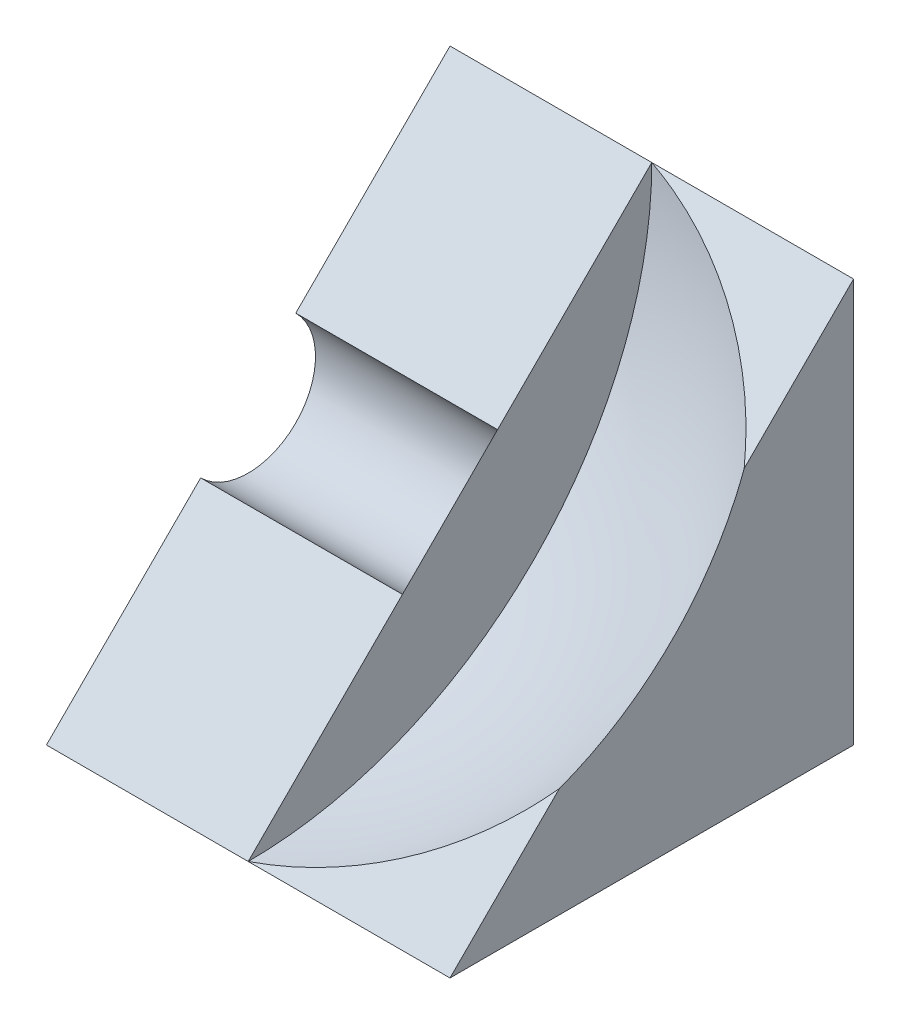
ISO-10303-21;
HEADER;
FILE_DESCRIPTION(('STEP AP214'),'2;1');
FILE_NAME('part.step','',(''),(''),'','','');
FILE_SCHEMA(('AUTOMOTIVE_DESIGN { 1 0 10303 214 1 1 1 1 }'));
ENDSEC;
DATA;
#1=APPLICATION_CONTEXT('core data for automotive mechanical design processes');
#2=APPLICATION_PROTOCOL_DEFINITION('international standard','automotive_design',2000,#1);
#3=PRODUCT_CONTEXT('',#1,'mechanical');
#4=PRODUCT('Part','Part','',(#3));
#5=PRODUCT_RELATED_PRODUCT_CATEGORY('part','',(#4));
#6=PRODUCT_DEFINITION_FORMATION('','',#4);
#7=PRODUCT_DEFINITION_CONTEXT('part definition',#1,'design');
#8=PRODUCT_DEFINITION('design','',#6,#7);
#9=PRODUCT_DEFINITION_SHAPE('','',#8);
#10=(LENGTH_UNIT() NAMED_UNIT(*) SI_UNIT(.MILLI.,.METRE.));
#11=(NAMED_UNIT(*) PLANE_ANGLE_UNIT() SI_UNIT($,.RADIAN.));
#12=(NAMED_UNIT(*) SI_UNIT($,.STERADIAN.) SOLID_ANGLE_UNIT());
#13=UNCERTAINTY_MEASURE_WITH_UNIT(LENGTH_MEASURE(1.E-05),#10,'distance_accuracy_value','');
#14=(GEOMETRIC_REPRESENTATION_CONTEXT(3) GLOBAL_UNCERTAINTY_ASSIGNED_CONTEXT((#13)) GLOBAL_UNIT_ASSIGNED_CONTEXT((#10,
#11,#12)) REPRESENTATION_CONTEXT('',''));
#15=CARTESIAN_POINT('',(0.,0.,0.));
#16=DIRECTION('',(0.,0.,1.));
#17=DIRECTION('',(1.,0.,0.));
#18=AXIS2_PLACEMENT_3D('',#15,#16,#17);
#19=CARTESIAN_POINT('',(85.,0.,59.99995));
#20=DIRECTION('',(0.,-0.70710707581468,-0.707106486558292));
#21=DIRECTION('',(0.,0.707106486558292,-0.70710707581468));
#22=AXIS2_PLACEMENT_3D('',#19,#20,#21);
#23=PLANE('',#22);
#24=CARTESIAN_POINT('',(29.9998,-5.1781123658666E-05,60.0000017811668));
#25=CARTESIAN_POINT('',(30.7075501017135,0.14654215159605,59.8534077262853));
#26=CARTESIAN_POINT('',(31.4110715698133,0.30314837625269,59.6968013711232));
#27=CARTESIAN_POINT('',(32.8086429667047,0.636266122760503,59.3636833470168));
#28=CARTESIAN_POINT('',(33.502692667805,0.812778122184188,59.1871712004996));
#29=CARTESIAN_POINT('',(35.5692390203095,1.37203048303115,58.6279183736082));
#30=CARTESIAN_POINT('',(36.9259504460386,1.78444945888903,58.2154990540673));
#31=CARTESIAN_POINT('',(39.5967446522564,2.68991853420449,57.310029224193));
#32=CARTESIAN_POINT('',(40.9104353927401,3.18354544419467,56.8164019028464));
#33=CARTESIAN_POINT('',(43.4743740622767,4.24713331774656,55.7528131429698));
#34=CARTESIAN_POINT('',(44.7246309538304,4.81708345603521,55.1828625297219));
#35=CARTESIAN_POINT('',(47.1542875204291,6.03238892460419,53.9675560483966));
#36=CARTESIAN_POINT('',(48.3335050164744,6.67792658930182,53.3220178457501));
#37=CARTESIAN_POINT('',(50.606875518546,8.04053280990178,51.959410489643));
#38=CARTESIAN_POINT('',(51.7010070921825,8.75761928513349,51.2423234168383));
#39=CARTESIAN_POINT('',(53.7869306309738,10.2560077223317,49.7439337309809));
#40=CARTESIAN_POINT('',(54.7791863920909,11.0369866502539,48.9629541522419));
#41=CARTESIAN_POINT('',(56.6541696629981,12.6614591635084,47.338480285258));
#42=CARTESIAN_POINT('',(57.5369931206411,13.5048969347006,46.4950418111998));
#43=CARTESIAN_POINT('',(58.6476660316205,14.6837584917256,45.3161792717886));
#44=CARTESIAN_POINT('',(58.9292890517796,14.9942740625198,45.005663442231));
#45=CARTESIAN_POINT('',(59.4767196027434,15.6220704863148,44.3778664952714));
#46=CARTESIAN_POINT('',(59.7425318069019,15.9393493021945,44.0605874149922));
#47=CARTESIAN_POINT('',(60.000225,16.2599595985482,43.7399768514629));
#48=B_SPLINE_CURVE_WITH_KNOTS('',3,(#24,#25,#26,#27,#28,#29,#30,#31,#32,#33,#34,#35,#36,#37,#38,
#39,#40,#41,#42,#43,#44,#45,#46,#47),.UNSPECIFIED.,.F.,.F.,(4,2,2,2,2,2,2,2,2,2,2,4),(0.,
2.21215957823001,4.42437224112848,8.84936625624993,13.3072670116011,17.7645361508409,
22.2327877777657,26.7021612963625,31.1501900926085,35.594290946876,37.1590825375816,
38.7234092856686),.UNSPECIFIED.);
#49=CARTESIAN_POINT('',(30.0000364707696,9.90699170863443E-07,59.9999307739114));
#50=VERTEX_POINT('',#49);
#51=CARTESIAN_POINT('',(30.0002913958802,4.9999958334239E-05,59.9999));
#52=VERTEX_POINT('',#51);
#53=EDGE_CURVE('E131',#50,#52,#48,.T.);
#54=ORIENTED_EDGE('',*,*,#53,.F.);
#55=DIRECTION('',(-1.,0.,0.));
#56=VECTOR('',#55,1.);
#57=CARTESIAN_POINT('',(85.,0.,59.99995));
#58=LINE('',#57,#56);
#59=CARTESIAN_POINT('',(60.,0.,59.99995));
#60=VERTEX_POINT('',#59);
#61=EDGE_CURVE('E165',#60,#50,#58,.T.);
#62=ORIENTED_EDGE('',*,*,#61,.F.);
#63=DIRECTION('',(0.,-0.707106486558292,0.70710707581468));
#64=VECTOR('',#63,1.);
#65=CARTESIAN_POINT('',(60.,-2.50000000041797E-05,59.9999750000208));
#66=LINE('',#65,#64);
#67=CARTESIAN_POINT('',(60.,16.2596796603646,43.7402567898797));
#68=VERTEX_POINT('',#67);
#69=EDGE_CURVE('E183',#68,#60,#66,.T.);
#70=ORIENTED_EDGE('',*,*,#69,.F.);
#71=EDGE_CURVE('E59',#52,#68,#48,.T.);
#72=ORIENTED_EDGE('',*,*,#71,.F.);
#73=EDGE_LOOP('',(#54,#62,#70,#72));
#74=FACE_BOUND('',#73,.T.);
#75=ADVANCED_FACE('F43',(#74),#23,.F.);
#76=CARTESIAN_POINT('',(60.000225,43.7399369097462,16.2599766402456));
#77=CARTESIAN_POINT('',(59.3844415223114,44.5061305786427,15.4937823328533));
#78=CARTESIAN_POINT('',(58.7221450644905,45.253327214195,14.7465850746361));
#79=CARTESIAN_POINT('',(57.3129519361885,46.7060616456861,13.293849432531));
#80=CARTESIAN_POINT('',(56.5661088783935,47.4116254147645,12.5882850754818));
#81=CARTESIAN_POINT('',(54.997564731696,48.7765648236264,11.2233445291685));
#82=CARTESIAN_POINT('',(54.1760704842793,49.4360596411124,10.5638491621025));
#83=CARTESIAN_POINT('',(52.4637754270321,50.7085549169874,9.2913528258131));
#84=CARTESIAN_POINT('',(51.5729626073562,51.3215472820608,8.67835994991187));
#85=CARTESIAN_POINT('',(49.6806322301687,52.529740649659,7.47016557548412));
#86=CARTESIAN_POINT('',(48.6757564949494,53.1223109183581,6.87759481297569));
#87=CARTESIAN_POINT('',(46.6047924463428,54.2513056469047,5.74859914359855));
#88=CARTESIAN_POINT('',(45.5387006703002,54.7877269258579,5.21217741762688));
#89=CARTESIAN_POINT('',(43.352219105635,55.8027849074502,4.1971185901515));
#90=CARTESIAN_POINT('',(42.2318053471819,56.2813957697124,3.71850732904632));
#91=CARTESIAN_POINT('',(39.9445047113908,57.1788585125453,2.8210438383265));
#92=CARTESIAN_POINT('',(38.7776293952838,57.5977251421244,2.40217685969136));
#93=CARTESIAN_POINT('',(36.3617796722984,58.3882945398994,1.61160680310735));
#94=CARTESIAN_POINT('',(35.1113613500782,58.7577906183774,1.24211041671545));
#95=CARTESIAN_POINT('',(32.5784602213533,59.4293047392637,0.570595736233094));
#96=CARTESIAN_POINT('',(31.2960683154422,59.7314941616912,0.268406061980658));
#97=CARTESIAN_POINT('',(29.9998,59.9999414247473,-4.1424781852638E-05));
#98=B_SPLINE_CURVE_WITH_KNOTS('',3,(#76,#77,#78,#79,#80,#81,#82,#83,#84,#85,#86,#87,#88,#89,#90,
#91,#92,#93,#94,#95,#96,#97),.UNSPECIFIED.,.F.,.F.,(4,2,2,2,2,2,2,2,2,2,4),(0.,3.73724174160161,
7.47212675993812,11.1969616631996,14.9224433588073,18.8438358241679,22.7654503200972,
26.6888112817308,30.6112020039389,34.6730668368085,38.7244677798828),.UNSPECIFIED.);
#99=CARTESIAN_POINT('',(60.,43.7402168478734,16.2596967018952));
#100=VERTEX_POINT('',#99);
#101=CARTESIAN_POINT('',(30.,59.9998999999167,8.33291768920219E-11));
#102=VERTEX_POINT('',#101);
#103=EDGE_CURVE('E121',#100,#102,#98,.T.);
#104=ORIENTED_EDGE('',*,*,#103,.F.);
#105=CARTESIAN_POINT('',(60.,59.9999,0.));
#106=VERTEX_POINT('',#105);
#107=EDGE_CURVE('E160',#106,#100,#66,.T.);
#108=ORIENTED_EDGE('',*,*,#107,.F.);
#109=DIRECTION('',(-1.,0.,0.));
#110=VECTOR('',#109,1.);
#111=CARTESIAN_POINT('',(85.,59.9999,0.));
#112=LINE('',#111,#110);
#113=EDGE_CURVE('E152',#106,#102,#112,.T.);
#114=ORIENTED_EDGE('',*,*,#113,.T.);
#115=EDGE_LOOP('',(#104,#108,#114));
#116=FACE_BOUND('',#115,.T.);
#117=ADVANCED_FACE('F159',(#116),#23,.F.);
#118=CARTESIAN_POINT('',(30.,60.0001,-0.00020000016666584));
#119=CARTESIAN_POINT('',(29.9999984336098,45.8579231283649,14.1419886566354));
#120=CARTESIAN_POINT('',(30.0000063081696,31.7157462567347,28.2841773134327));
#121=CARTESIAN_POINT('',(30.0000307960496,11.7156462567457,48.2842939801995));
#122=CARTESIAN_POINT('',(30.0000395882537,5.85772312838283,54.1422219901731));
#123=CARTESIAN_POINT('',(30.0000500002917,-0.000199999979198746,60.0001500001459));
#124=B_SPLINE_CURVE_WITH_KNOTS('',3,(#118,#119,#120,#121,#122,#123),.UNSPECIFIED.,.F.,.F.,(4,2,
4),(0.,60.0002000001401,84.8532733620257),.UNSPECIFIED.);
#125=CARTESIAN_POINT('',(30.0000054316123,37.0710304904511,22.9288886169737));
#126=VERTEX_POINT('',#125);
#127=EDGE_CURVE('E136',#102,#126,#124,.T.);
#128=ORIENTED_EDGE('',*,*,#127,.F.);
#129=CARTESIAN_POINT('',(0.,59.9999,0.));
#130=VERTEX_POINT('',#129);
#131=EDGE_CURVE('E144',#102,#130,#112,.T.);
#132=ORIENTED_EDGE('',*,*,#131,.T.);
#133=DIRECTION('',(0.,-0.707106486558292,0.70710707581468));
#134=VECTOR('',#133,1.);
#135=CARTESIAN_POINT('',(0.,0.,59.99995));
#136=LINE('',#135,#134);
#137=CARTESIAN_POINT('',(0.,37.0710304904503,22.9288886169728));
#138=VERTEX_POINT('',#137);
#139=EDGE_CURVE('E162',#130,#138,#136,.T.);
#140=ORIENTED_EDGE('',*,*,#139,.T.);
#141=DIRECTION('',(-1.,0.,0.));
#142=VECTOR('',#141,1.);
#143=CARTESIAN_POINT('',(30.,37.0710304904503,22.9288886169728));
#144=LINE('',#143,#142);
#145=EDGE_CURVE('E67',#138,#126,#144,.F.);
#146=ORIENTED_EDGE('',*,*,#145,.T.);
#147=EDGE_LOOP('',(#128,#132,#140,#146));
#148=FACE_BOUND('',#147,.T.);
#149=ADVANCED_FACE('F142',(#148),#23,.F.);
#150=EDGE_CURVE('E138',#126,#50,#124,.T.);
#151=ORIENTED_EDGE('',*,*,#150,.F.);
#152=DIRECTION('',(0.,0.707106486558292,-0.70710707581468));
#153=VECTOR('',#152,1.);
#154=CARTESIAN_POINT('',(30.,0.,59.99995));
#155=LINE('',#154,#153);
#156=CARTESIAN_POINT('',(30.,22.9289007595178,37.071030133033));
#157=VERTEX_POINT('',#156);
#158=EDGE_CURVE('E12',#157,#126,#155,.T.);
#159=ORIENTED_EDGE('',*,*,#158,.F.);
#160=DIRECTION('',(-1.,0.,0.));
#161=VECTOR('',#160,1.);
#162=CARTESIAN_POINT('',(30.,22.9289007595178,37.071030133033));
#163=LINE('',#162,#161);
#164=CARTESIAN_POINT('',(0.,22.9289007595178,37.071030133033));
#165=VERTEX_POINT('',#164);
#166=EDGE_CURVE('E157',#157,#165,#163,.T.);
#167=ORIENTED_EDGE('',*,*,#166,.T.);
#168=CARTESIAN_POINT('',(0.,2.50000208271501E-05,59.999975));
#169=VERTEX_POINT('',#168);
#170=EDGE_CURVE('E161',#165,#169,#136,.T.);
#171=ORIENTED_EDGE('',*,*,#170,.T.);
#172=CARTESIAN_POINT('',(30.,0.,59.99995));
#173=DIRECTION('',(-1.,0.,0.));
#174=VECTOR('',#173,1.);
#175=LINE('',#172,#174);
#176=EDGE_CURVE('E273',#50,#169,#175,.T.);
#177=ORIENTED_EDGE('',*,*,#176,.F.);
#178=EDGE_LOOP('',(#151,#159,#167,#171,#177));
#179=FACE_BOUND('',#178,.T.);
#180=ADVANCED_FACE('F221',(#179),#23,.F.);
#181=CARTESIAN_POINT('',(60.,0.,60.));
#182=DIRECTION('',(-1.,0.,0.));
#183=DIRECTION('',(0.,0.,1.));
#184=AXIS2_PLACEMENT_3D('',#181,#182,#183);
#185=PLANE('',#184);
#186=CARTESIAN_POINT('',(60.,27.0030565653427,27.0030837840858));
#187=CARTESIAN_POINT('',(60.,27.8815241833327,26.1246241588315));
#188=CARTESIAN_POINT('',(60.,28.7952038700235,25.281146576921));
#189=CARTESIAN_POINT('',(60.,30.687047048745,23.6697084677748));
#190=CARTESIAN_POINT('',(60.,31.6652213859136,22.9017606956759));
#191=CARTESIAN_POINT('',(60.,33.6806779052198,21.4456903390772));
#192=CARTESIAN_POINT('',(60.,34.7180133660953,20.7576414574266));
#193=CARTESIAN_POINT('',(60.,36.8442979040572,19.466615730743));
#194=CARTESIAN_POINT('',(60.,37.9332465182822,18.8636381229924));
#195=CARTESIAN_POINT('',(60.,40.2167569729813,17.7159735242071));
#196=CARTESIAN_POINT('',(60.,41.4138366420649,17.1762881762569));
#197=CARTESIAN_POINT('',(60.,43.8492481711442,16.1996651717968));
#198=CARTESIAN_POINT('',(60.,45.0875820661537,15.7627325925323));
#199=CARTESIAN_POINT('',(60.,47.5965898461612,14.9947650089843));
#200=CARTESIAN_POINT('',(60.,48.8672618712413,14.6637239291754));
#201=CARTESIAN_POINT('',(60.,51.4319594719834,14.1098654702487));
#202=CARTESIAN_POINT('',(60.,52.7259847599509,13.8870467588567));
#203=CARTESIAN_POINT('',(60.,55.3282380283316,13.5512059645342));
#204=CARTESIAN_POINT('',(60.,56.6364663539308,13.4381865561988));
#205=CARTESIAN_POINT('',(60.,59.2577974602142,13.3227573942381));
#206=CARTESIAN_POINT('',(60.,60.5709002553585,13.3203479689972));
#207=CARTESIAN_POINT('',(60.,63.1926389449041,13.4261565731029));
#208=CARTESIAN_POINT('',(60.,64.5012748467835,13.5343744171548));
#209=CARTESIAN_POINT('',(60.,67.1047774269789,13.8606678207731));
#210=CARTESIAN_POINT('',(60.,68.3996441146766,14.0787433054821));
#211=CARTESIAN_POINT('',(60.,70.9664021858641,14.623201291212));
#212=CARTESIAN_POINT('',(60.,72.2382935922371,14.9495836843541));
#213=CARTESIAN_POINT('',(60.,74.7500602514152,15.7083352234821));
#214=CARTESIAN_POINT('',(60.,75.9899354995041,16.1407043850806));
#215=CARTESIAN_POINT('',(60.,78.4288585620879,17.1083570113837));
#216=CARTESIAN_POINT('',(60.,79.62790625422,17.6436407844983));
#217=CARTESIAN_POINT('',(60.,81.9766457334035,18.8133162258413));
#218=CARTESIAN_POINT('',(60.,83.1263375217424,19.4477078914846));
#219=CARTESIAN_POINT('',(60.,85.3681907272418,20.8110884490453));
#220=CARTESIAN_POINT('',(60.,86.4603521882824,21.5400772688092));
#221=CARTESIAN_POINT('',(60.,88.57938106006,23.0874698313954));
#222=CARTESIAN_POINT('',(60.,89.6062484706591,23.9058735744065));
#223=CARTESIAN_POINT('',(60.,91.5873873197327,25.6262763134674));
#224=CARTESIAN_POINT('',(60.,92.5416588677207,26.5282751834063));
#225=CARTESIAN_POINT('',(60.,94.3708234173451,28.4094565604671));
#226=CARTESIAN_POINT('',(60.,95.2457164190523,29.3886390675202));
#227=CARTESIAN_POINT('',(60.,96.9099043228468,31.417226818686));
#228=CARTESIAN_POINT('',(60.,97.6991991836356,32.4666320966787));
#229=CARTESIAN_POINT('',(60.,99.1865789110362,34.6282043296687));
#230=CARTESIAN_POINT('',(60.,99.8846637775717,35.7403712847185));
#231=CARTESIAN_POINT('',(60.,101.184660906457,38.0195606537633));
#232=CARTESIAN_POINT('',(60.,101.78657311663,39.1865830975186));
#233=CARTESIAN_POINT('',(60.,102.889945237783,41.5671860500122));
#234=CARTESIAN_POINT('',(60.,103.391405148739,42.7807665587624));
#235=CARTESIAN_POINT('',(60.,104.290307505411,45.2458575738944));
#236=CARTESIAN_POINT('',(60.,104.6877499707,46.4973680731395));
#237=CARTESIAN_POINT('',(60.,105.375791981346,49.0294217954605));
#238=CARTESIAN_POINT('',(60.,105.666391526743,50.3099650185256));
#239=CARTESIAN_POINT('',(60.,106.138681669569,52.8909800771902));
#240=CARTESIAN_POINT('',(60.,106.320372285123,54.1914519094729));
#241=CARTESIAN_POINT('',(60.,106.573552932593,56.8030788209562));
#242=CARTESIAN_POINT('',(60.,106.64504296451,58.1142339001565));
#243=CARTESIAN_POINT('',(60.,106.677314194546,60.737905858605));
#244=CARTESIAN_POINT('',(60.,106.638095386033,62.0504227379346));
#245=CARTESIAN_POINT('',(60.,106.449227743081,64.6674870100601));
#246=CARTESIAN_POINT('',(60.,106.299578908632,65.9720344028553));
#247=CARTESIAN_POINT('',(60.,105.890915117839,68.5638852125254));
#248=CARTESIAN_POINT('',(60.,105.631900156387,69.8511886285946));
#249=CARTESIAN_POINT('',(60.,105.006345552082,72.3993994661301));
#250=CARTESIAN_POINT('',(60.,104.639805909228,73.660306887596));
#251=CARTESIAN_POINT('',(60.,103.801807825544,76.1467614216089));
#252=CARTESIAN_POINT('',(60.,103.330349386199,77.3723085346566));
#253=CARTESIAN_POINT('',(60.,102.285865493567,79.7793295645343));
#254=CARTESIAN_POINT('',(60.,101.712840040283,80.9608034813655));
#255=CARTESIAN_POINT('',(60.,100.469295999058,83.2712785257531));
#256=CARTESIAN_POINT('',(60.,99.7987774129118,84.4002796542758));
#257=CARTESIAN_POINT('',(60.,98.3650140833319,86.5977826237667));
#258=CARTESIAN_POINT('',(60.,97.6017693398995,87.6662844647361));
#259=CARTESIAN_POINT('',(60.,95.9879799142822,89.7351924441009));
#260=CARTESIAN_POINT('',(60.,95.1374352327155,90.7355985829787));
#261=CARTESIAN_POINT('',(60.,93.3550927891557,92.6612028783633));
#262=CARTESIAN_POINT('',(60.,92.4232950271617,93.5864010348694));
#263=CARTESIAN_POINT('',(60.,90.4850709148135,95.3550117900581));
#264=CARTESIAN_POINT('',(60.,89.4786445620283,96.1984243860768));
#265=CARTESIAN_POINT('',(60.,87.398318383322,97.797467827651));
#266=CARTESIAN_POINT('',(60.,86.3244185573965,98.5530986732009));
#267=CARTESIAN_POINT('',(60.,84.1167801750315,99.9712065581468));
#268=CARTESIAN_POINT('',(60.,82.983041616313,100.633683593995));
#269=CARTESIAN_POINT('',(60.,80.6637860085812,101.86077400998));
#270=CARTESIAN_POINT('',(60.,79.4782689595694,102.425387390119));
#271=CARTESIAN_POINT('',(60.,77.0638848195076,103.452736375638));
#272=CARTESIAN_POINT('',(60.,75.8350177331698,103.915471992091));
#273=CARTESIAN_POINT('',(60.,73.3426699044526,104.735775755496));
#274=CARTESIAN_POINT('',(60.,72.0791891620806,105.09334390247));
#275=CARTESIAN_POINT('',(60.,69.5265967595927,105.700770596812));
#276=CARTESIAN_POINT('',(60.,68.2374851024536,105.950629156691));
#277=CARTESIAN_POINT('',(60.,65.6427955363699,106.340860393069));
#278=CARTESIAN_POINT('',(60.,64.3372176274238,106.481233069558));
#279=CARTESIAN_POINT('',(60.,61.7188769846141,106.651494602916));
#280=CARTESIAN_POINT('',(60.,60.4061142483018,106.681383422125));
#281=CARTESIAN_POINT('',(60.,57.7827373516399,106.630464644721));
#282=CARTESIAN_POINT('',(60.,56.4721231912917,106.549657048038));
#283=CARTESIAN_POINT('',(60.,53.8623607719239,106.277919895162));
#284=CARTESIAN_POINT('',(60.,52.5632125160639,106.086990308626));
#285=CARTESIAN_POINT('',(60.,49.9856184462165,105.596366548816));
#286=CARTESIAN_POINT('',(60.,48.7071726322202,105.29667237559));
#287=CARTESIAN_POINT('',(60.,46.1800735653989,104.590650405755));
#288=CARTESIAN_POINT('',(60.,44.9314202860087,104.184322704233));
#289=CARTESIAN_POINT('',(60.,42.4727822771827,103.267922297225));
#290=CARTESIAN_POINT('',(60.,41.2627975477038,102.757849591855));
#291=CARTESIAN_POINT('',(60.,38.8900992772033,101.637585664949));
#292=CARTESIAN_POINT('',(60.,37.7273857210211,101.027394475521));
#293=CARTESIAN_POINT('',(60.,35.4574955691754,99.7112315516458));
#294=CARTESIAN_POINT('',(60.,34.3503189735673,99.0052598171026));
#295=CARTESIAN_POINT('',(60.,32.199372443418,97.5025536782945));
#296=CARTESIAN_POINT('',(60.,31.1556026061049,96.7058191348591));
#297=CARTESIAN_POINT('',(60.,29.1388920271862,95.0272525663696));
#298=CARTESIAN_POINT('',(60.,28.1659512856051,94.1454205412862));
#299=CARTESIAN_POINT('',(60.,26.2978174122471,92.3029297744102));
#300=CARTESIAN_POINT('',(60.,25.4026241575813,91.3422711572166));
#301=CARTESIAN_POINT('',(60.,23.6963478111576,89.3489556937655));
#302=CARTESIAN_POINT('',(60.,22.8852647194695,88.3162988474481));
#303=CARTESIAN_POINT('',(60.,21.3529737522374,86.1863267429865));
#304=CARTESIAN_POINT('',(60.,20.631766023505,85.0890113792269));
#305=CARTESIAN_POINT('',(60.,19.2843547051817,82.8375250608429));
#306=CARTESIAN_POINT('',(60.,18.6581511141056,81.6833541071074));
#307=CARTESIAN_POINT('',(60.,17.5051910402753,79.3263437574638));
#308=CARTESIAN_POINT('',(60.,16.9784361012337,78.1235036064298));
#309=CARTESIAN_POINT('',(60.,16.0281303332011,75.6777231977864));
#310=CARTESIAN_POINT('',(60.,15.6045795213786,74.4347829335061));
#311=CARTESIAN_POINT('',(60.,14.8637054479783,71.917680264905));
#312=CARTESIAN_POINT('',(60.,14.546378737611,70.6435188756855));
#313=CARTESIAN_POINT('',(60.,14.020190079864,68.0729943813456));
#314=CARTESIAN_POINT('',(60.,13.811328038751,66.7766312954124));
#315=CARTESIAN_POINT('',(60.,13.5035668527558,64.1710346126222));
#316=CARTESIAN_POINT('',(60.,13.4046579127234,62.8618021727136));
#317=CARTESIAN_POINT('',(60.,13.3174724971384,60.2396544108722));
#318=CARTESIAN_POINT('',(60.,13.3291963931483,58.9267390765852));
#319=CARTESIAN_POINT('',(60.,13.4632084782088,56.3062819301611));
#320=CARTESIAN_POINT('',(60.,13.5855202895161,54.9987413260462));
#321=CARTESIAN_POINT('',(60.,13.9398693790154,52.3986314507958));
#322=CARTESIAN_POINT('',(60.,14.1719051635026,51.1060619760993));
#323=CARTESIAN_POINT('',(60.,14.7441587517332,48.5445830404467));
#324=CARTESIAN_POINT('',(60.,15.0844175885743,47.2756827472317));
#325=CARTESIAN_POINT('',(60.,15.8706982532688,44.7709961669276));
#326=CARTESIAN_POINT('',(60.,16.3167261438092,43.535211782565));
#327=CARTESIAN_POINT('',(60.,17.3108759234009,41.106785905384));
#328=CARTESIAN_POINT('',(60.,17.8589028893357,39.9141055212622));
#329=CARTESIAN_POINT('',(60.,19.0533784566334,37.5793025145414));
#330=CARTESIAN_POINT('',(60.,19.6998046378638,36.4371684513511));
#331=CARTESIAN_POINT('',(60.,20.8623700275712,34.5710980407771));
#332=CARTESIAN_POINT('',(60.,21.3531603125506,33.8312310997186));
#333=CARTESIAN_POINT('',(60.,22.3762164896427,32.380561729765));
#334=CARTESIAN_POINT('',(60.,22.9084871174614,31.6697626336386));
#335=CARTESIAN_POINT('',(60.,24.0126372371983,30.279767355131));
#336=CARTESIAN_POINT('',(60.,24.5845119536727,29.6005673789956));
#337=CARTESIAN_POINT('',(60.,25.7659568847067,28.275991906897));
#338=CARTESIAN_POINT('',(60.,26.3755224143458,27.6306122254646));
#339=CARTESIAN_POINT('',(60.,27.0030565653427,27.0030837840858));
#340=B_SPLINE_CURVE_WITH_KNOTS('',3,(#186,#187,#188,#189,#190,#191,#192,#193,#194,#195,#196,
#197,#198,#199,#200,#201,#202,#203,#204,#205,#206,#207,#208,#209,#210,#211,#212,#213,#214,#215,
#216,#217,#218,#219,#220,#221,#222,#223,#224,#225,#226,#227,#228,#229,#230,#231,#232,#233,#234,
#235,#236,#237,#238,#239,#240,#241,#242,#243,#244,#245,#246,#247,#248,#249,#250,#251,#252,#253,
#254,#255,#256,#257,#258,#259,#260,#261,#262,#263,#264,#265,#266,#267,#268,#269,#270,#271,#272,
#273,#274,#275,#276,#277,#278,#279,#280,#281,#282,#283,#284,#285,#286,#287,#288,#289,#290,#291,
#292,#293,#294,#295,#296,#297,#298,#299,#300,#301,#302,#303,#304,#305,#306,#307,#308,#309,#310,
#311,#312,#313,#314,#315,#316,#317,#318,#319,#320,#321,#322,#323,#324,#325,#326,#327,#328,#329,
#330,#331,#332,#333,#334,#335,#336,#337,#338,#339),.UNSPECIFIED.,.T.,.F.,(4,2,2,2,2,2,2,2,2,2,2,
2,2,2,2,2,2,2,2,2,2,2,2,2,2,2,2,2,2,2,2,2,2,2,2,2,2,2,2,2,2,2,2,2,2,2,2,2,2,2,2,2,2,2,2,2,2,2,2,
2,2,2,2,2,2,2,2,2,2,2,2,2,2,2,2,2,4),(0.,3.72629675997922,7.453221723681,11.1835577347996,
14.9138602989763,18.8484800000682,22.7832940787385,26.7178823569174,30.6524221970214,
34.5870578759588,38.521705236233,42.4563460061921,46.3909840950735,50.3256182648772,
54.2602530142817,58.1948995550148,62.1295459931249,66.0641894301199,69.9988328754202,
73.9334703850518,77.8681078911771,81.8027472956402,85.737386703396,89.6720282458149,
93.6066697892311,97.5413105923121,101.475951393909,105.410591540639,109.345231687287,
113.279872069597,117.214512452274,121.149153018784,125.083793585345,129.018434096188,
132.953074606925,136.8877150452,140.822355483402,144.75699589374,148.691636304122,
152.626276842663,156.560917381459,160.495558070104,164.430198758646,168.364839019494,
172.299479279513,176.234119082572,180.168758886011,184.103400030574,188.038041177565,
191.972683408727,195.907325638182,199.841964359088,203.776603075617,207.711240530234,
211.645877988767,215.580521480538,219.515164973669,223.449802247531,227.384439524661,
231.319083228944,235.253726871722,239.188431585814,243.123136954463,247.057714562216,
250.992288769774,254.926512438474,258.860749320344,262.795826777924,266.730850667679,
270.667368315766,274.604111659789,278.537209517678,282.469412562061,285.131642430989,
287.794176686506,290.456390451921,293.118273970162),.UNSPECIFIED.);
#341=EDGE_CURVE('E126',#68,#100,#340,.T.);
#342=ORIENTED_EDGE('',*,*,#341,.F.);
#343=ORIENTED_EDGE('',*,*,#69,.T.);
#344=DIRECTION('',(0.,0.,-1.));
#345=VECTOR('',#344,1.);
#346=CARTESIAN_POINT('',(60.,0.,60.));
#347=LINE('',#346,#345);
#348=CARTESIAN_POINT('',(60.,0.,0.));
#349=VERTEX_POINT('',#348);
#350=EDGE_CURVE('E177',#60,#349,#347,.T.);
#351=ORIENTED_EDGE('',*,*,#350,.T.);
#352=DIRECTION('',(0.,1.,0.));
#353=VECTOR('',#352,1.);
#354=CARTESIAN_POINT('',(60.,0.,0.));
#355=LINE('',#354,#353);
#356=EDGE_CURVE('E171',#349,#106,#355,.T.);
#357=ORIENTED_EDGE('',*,*,#356,.T.);
#358=ORIENTED_EDGE('',*,*,#107,.T.);
#359=EDGE_LOOP('',(#342,#343,#351,#357,#358));
#360=FACE_BOUND('',#359,.T.);
#361=ADVANCED_FACE('F290',(#360),#185,.F.);
#362=CARTESIAN_POINT('',(0.,0.,0.));
#363=DIRECTION('',(0.,0.,-1.));
#364=DIRECTION('',(-1.,0.,0.));
#365=AXIS2_PLACEMENT_3D('',#362,#363,#364);
#366=PLANE('',#365);
#367=DIRECTION('',(0.,-1.,0.));
#368=VECTOR('',#367,1.);
#369=CARTESIAN_POINT('',(0.,0.,0.));
#370=LINE('',#369,#368);
#371=CARTESIAN_POINT('',(0.,20.,0.));
#372=VERTEX_POINT('',#371);
#373=EDGE_CURVE('E156',#130,#372,#370,.T.);
#374=ORIENTED_EDGE('',*,*,#373,.F.);
#375=ORIENTED_EDGE('',*,*,#131,.F.);
#376=ORIENTED_EDGE('',*,*,#113,.F.);
#377=ORIENTED_EDGE('',*,*,#356,.F.);
#378=DIRECTION('',(1.,0.,0.));
#379=VECTOR('',#378,1.);
#380=CARTESIAN_POINT('',(0.,0.,0.));
#381=LINE('',#380,#379);
#382=CARTESIAN_POINT('',(30.,0.,0.));
#383=VERTEX_POINT('',#382);
#384=EDGE_CURVE('E194',#383,#349,#381,.T.);
#385=ORIENTED_EDGE('',*,*,#384,.F.);
#386=DIRECTION('',(0.,-1.,0.));
#387=VECTOR('',#386,1.);
#388=CARTESIAN_POINT('',(30.,0.,0.));
#389=LINE('',#388,#387);
#390=CARTESIAN_POINT('',(30.,20.,0.));
#391=VERTEX_POINT('',#390);
#392=EDGE_CURVE('E200',#391,#383,#389,.T.);
#393=ORIENTED_EDGE('',*,*,#392,.F.);
#394=DIRECTION('',(-1.,0.,0.));
#395=VECTOR('',#394,1.);
#396=CARTESIAN_POINT('',(30.,20.,0.));
#397=LINE('',#396,#395);
#398=EDGE_CURVE('E178',#391,#372,#397,.T.);
#399=ORIENTED_EDGE('',*,*,#398,.T.);
#400=EDGE_LOOP('',(#374,#375,#376,#377,#385,#393,#399));
#401=FACE_BOUND('',#400,.T.);
#402=ADVANCED_FACE('F150',(#401),#366,.T.);
#403=CARTESIAN_POINT('',(0.,0.,60.));
#404=DIRECTION('',(1.,0.,0.));
#405=DIRECTION('',(0.,0.,-1.));
#406=AXIS2_PLACEMENT_3D('',#403,#404,#405);
#407=PLANE('',#406);
#408=ORIENTED_EDGE('',*,*,#170,.F.);
#409=CARTESIAN_POINT('',(0.,30.000006250015,30.));
#410=DIRECTION('',(-1.,0.,0.));
#411=DIRECTION('',(0.,0.,1.));
#412=AXIS2_PLACEMENT_3D('',#409,#410,#411);
#413=CIRCLE('',#412,10.);
#414=EDGE_CURVE('E130',#138,#165,#413,.T.);
#415=ORIENTED_EDGE('',*,*,#414,.F.);
#416=ORIENTED_EDGE('',*,*,#139,.F.);
#417=ORIENTED_EDGE('',*,*,#373,.T.);
#418=DIRECTION('',(0.,0.707106781186548,-0.707106781186548));
#419=VECTOR('',#418,1.);
#420=CARTESIAN_POINT('',(0.,20.,0.));
#421=LINE('',#420,#419);
#422=CARTESIAN_POINT('',(0.,0.,20.));
#423=VERTEX_POINT('',#422);
#424=EDGE_CURVE('E196',#423,#372,#421,.T.);
#425=ORIENTED_EDGE('',*,*,#424,.F.);
#426=DIRECTION('',(0.,0.,-1.));
#427=VECTOR('',#426,1.);
#428=CARTESIAN_POINT('',(0.,0.,60.));
#429=LINE('',#428,#427);
#430=EDGE_CURVE('E190',#169,#423,#429,.T.);
#431=ORIENTED_EDGE('',*,*,#430,.F.);
#432=EDGE_LOOP('',(#408,#415,#416,#417,#425,#431));
#433=FACE_BOUND('',#432,.T.);
#434=ADVANCED_FACE('F281',(#433),#407,.F.);
#435=CARTESIAN_POINT('',(0.,0.,60.));
#436=DIRECTION('',(0.,1.,0.));
#437=DIRECTION('',(0.,0.,1.));
#438=AXIS2_PLACEMENT_3D('',#435,#436,#437);
#439=PLANE('',#438);
#440=ORIENTED_EDGE('',*,*,#350,.F.);
#441=ORIENTED_EDGE('',*,*,#61,.T.);
#442=ORIENTED_EDGE('',*,*,#176,.T.);
#443=ORIENTED_EDGE('',*,*,#430,.T.);
#444=DIRECTION('',(-1.,0.,0.));
#445=VECTOR('',#444,1.);
#446=CARTESIAN_POINT('',(30.,0.,20.));
#447=LINE('',#446,#445);
#448=CARTESIAN_POINT('',(30.,0.,20.));
#449=VERTEX_POINT('',#448);
#450=EDGE_CURVE('E198',#449,#423,#447,.T.);
#451=ORIENTED_EDGE('',*,*,#450,.F.);
#452=DIRECTION('',(0.,0.,1.));
#453=VECTOR('',#452,1.);
#454=CARTESIAN_POINT('',(30.,0.,20.));
#455=LINE('',#454,#453);
#456=EDGE_CURVE('E204',#383,#449,#455,.T.);
#457=ORIENTED_EDGE('',*,*,#456,.F.);
#458=ORIENTED_EDGE('',*,*,#384,.T.);
#459=EDGE_LOOP('',(#440,#441,#442,#443,#451,#457,#458));
#460=FACE_BOUND('',#459,.T.);
#461=ADVANCED_FACE('F45',(#460),#439,.F.);
#462=CARTESIAN_POINT('',(30.,20.,0.));
#463=DIRECTION('',(0.,0.707106781186547,0.707106781186547));
#464=DIRECTION('',(0.,-0.707106781186548,0.707106781186548));
#465=AXIS2_PLACEMENT_3D('',#462,#463,#464);
#466=PLANE('',#465);
#467=ORIENTED_EDGE('',*,*,#424,.T.);
#468=ORIENTED_EDGE('',*,*,#398,.F.);
#469=DIRECTION('',(0.,0.707106781186548,-0.707106781186548));
#470=VECTOR('',#469,1.);
#471=CARTESIAN_POINT('',(30.,20.,0.));
#472=LINE('',#471,#470);
#473=EDGE_CURVE('E52',#449,#391,#472,.T.);
#474=ORIENTED_EDGE('',*,*,#473,.F.);
#475=ORIENTED_EDGE('',*,*,#450,.T.);
#476=EDGE_LOOP('',(#467,#468,#474,#475));
#477=FACE_BOUND('',#476,.T.);
#478=ADVANCED_FACE('F284',(#477),#466,.F.);
#479=CARTESIAN_POINT('',(30.,0.,0.));
#480=DIRECTION('',(-1.,0.,0.));
#481=DIRECTION('',(0.,0.,1.));
#482=AXIS2_PLACEMENT_3D('',#479,#480,#481);
#483=PLANE('',#482);
#484=ORIENTED_EDGE('',*,*,#392,.T.);
#485=ORIENTED_EDGE('',*,*,#456,.T.);
#486=ORIENTED_EDGE('',*,*,#473,.T.);
#487=EDGE_LOOP('',(#484,#485,#486));
#488=FACE_BOUND('',#487,.T.);
#489=ADVANCED_FACE('F222',(#488),#483,.T.);
#490=CARTESIAN_POINT('',(30.,30.000006250015,30.));
#491=DIRECTION('',(-1.,0.,0.));
#492=DIRECTION('',(0.,0.,1.));
#493=AXIS2_PLACEMENT_3D('',#490,#491,#492);
#494=PLANE('',#493);
#495=ORIENTED_EDGE('',*,*,#158,.T.);
#496=CARTESIAN_POINT('',(30.,30.000006250015,30.));
#497=DIRECTION('',(-1.,0.,0.));
#498=DIRECTION('',(0.,0.,1.));
#499=AXIS2_PLACEMENT_3D('',#496,#497,#498);
#500=CIRCLE('',#499,10.);
#501=EDGE_CURVE('E256',#126,#157,#500,.T.);
#502=ORIENTED_EDGE('',*,*,#501,.T.);
#503=EDGE_LOOP('',(#495,#502));
#504=FACE_BOUND('',#503,.T.);
#505=ADVANCED_FACE('F248',(#504),#494,.T.);
#506=CARTESIAN_POINT('',(30.,30.000006250015,30.));
#507=DIRECTION('',(-1.,0.,0.));
#508=DIRECTION('',(0.,0.,1.));
#509=AXIS2_PLACEMENT_3D('',#506,#507,#508);
#510=CYLINDRICAL_SURFACE('',#509,10.);
#511=ORIENTED_EDGE('',*,*,#501,.F.);
#512=ORIENTED_EDGE('',*,*,#145,.F.);
#513=ORIENTED_EDGE('',*,*,#414,.T.);
#514=ORIENTED_EDGE('',*,*,#166,.F.);
#515=EDGE_LOOP('',(#511,#512,#513,#514));
#516=FACE_BOUND('',#515,.T.);
#517=ADVANCED_FACE('F246',(#516),#510,.F.);
#518=CARTESIAN_POINT('',(14.3259711396058,60.,60.0000130616907));
#519=DIRECTION('',(-0.999999999999653,0.,8.33333333819889E-07));
#520=DIRECTION('',(8.33333333819889E-07,0.,0.999999999999653));
#521=AXIS2_PLACEMENT_3D('',#518,#519,#520);
#522=DEGENERATE_TOROIDAL_SURFACE('',#521,15.6740157987144,77.2802265474354,.F.);
#523=ORIENTED_EDGE('',*,*,#103,.T.);
#524=CARTESIAN_POINT('',(30.00005,60.,59.9999999999583));
#525=DIRECTION('',(-0.999999999999653,0.,8.33333333819889E-07));
#526=DIRECTION('',(8.33333333819889E-07,0.,0.999999999999653));
#527=AXIS2_PLACEMENT_3D('',#524,#525,#526);
#528=CIRCLE('',#527,59.9999999999792);
#529=EDGE_CURVE('E124',#102,#50,#528,.T.);
#530=ORIENTED_EDGE('',*,*,#529,.T.);
#531=ORIENTED_EDGE('',*,*,#53,.T.);
#532=ORIENTED_EDGE('',*,*,#71,.T.);
#533=ORIENTED_EDGE('',*,*,#341,.T.);
#534=EDGE_LOOP('',(#523,#530,#531,#532,#533));
#535=FACE_BOUND('',#534,.T.);
#536=ADVANCED_FACE('F123',(#535),#522,.T.);
#537=CARTESIAN_POINT('',(30.00005,60.,59.9999999999583));
#538=DIRECTION('',(0.999999999999653,0.,-8.33333333819889E-07));
#539=DIRECTION('',(-8.33333333819889E-07,0.,-0.999999999999653));
#540=AXIS2_PLACEMENT_3D('',#537,#538,#539);
#541=CONICAL_SURFACE('',#540,59.9999999999792,1.57079549346156);
#542=ORIENTED_EDGE('',*,*,#127,.T.);
#543=ORIENTED_EDGE('',*,*,#150,.T.);
#544=ORIENTED_EDGE('',*,*,#529,.F.);
#545=EDGE_LOOP('',(#542,#543,#544));
#546=FACE_BOUND('',#545,.T.);
#547=ADVANCED_FACE('F135',(#546),#541,.F.);
#548=CLOSED_SHELL('',(#75,#117,#149,#180,#361,#402,#434,#461,#478,#489,#505,#517,#536,#547));
#549=MANIFOLD_SOLID_BREP('B2',#548);
#550=CARTESIAN_POINT('',(30.,59.9999,30.));
#551=DIRECTION('',(0.,1.,0.));
#552=DIRECTION('',(0.,0.,1.));
#553=AXIS2_PLACEMENT_3D('',#550,#551,#552);
#554=CYLINDRICAL_SURFACE('',#553,30.);
#555=DIRECTION('',(0.,1.,0.));
#556=VECTOR('',#555,1.);
#557=CARTESIAN_POINT('',(30.,59.9999,0.));
#558=LINE('',#557,#556);
#559=CARTESIAN_POINT('',(30.,59.9999,0.));
#560=VERTEX_POINT('',#559);
#561=CARTESIAN_POINT('',(30.,60.,0.));
#562=VERTEX_POINT('',#561);
#563=EDGE_CURVE('E460',#560,#562,#558,.T.);
#564=ORIENTED_EDGE('',*,*,#563,.F.);
#565=CARTESIAN_POINT('',(30.,89.9999250000417,30.));
#566=DIRECTION('',(0.,0.707106486558292,-0.70710707581468));
#567=DIRECTION('',(0.,0.70710707581468,0.707106486558292));
#568=AXIS2_PLACEMENT_3D('',#565,#566,#567);
#569=ELLIPSE('',#568,42.4264245488955,30.);
#570=CARTESIAN_POINT('',(30.0774595701028,60.,9.99999166789028E-05));
#571=VERTEX_POINT('',#570);
#572=EDGE_CURVE('E450',#560,#571,#569,.F.);
#573=ORIENTED_EDGE('',*,*,#572,.T.);
#574=CARTESIAN_POINT('',(30.,60.,30.));
#575=DIRECTION('',(0.,1.,0.));
#576=DIRECTION('',(0.,0.,-1.));
#577=AXIS2_PLACEMENT_3D('',#574,#575,#576);
#578=CIRCLE('',#577,30.);
#579=EDGE_CURVE('E465',#571,#562,#578,.T.);
#580=ORIENTED_EDGE('',*,*,#579,.T.);
#581=EDGE_LOOP('',(#564,#573,#580));
#582=FACE_BOUND('',#581,.T.);
#583=ADVANCED_FACE('F420',(#582),#554,.F.);
#584=CARTESIAN_POINT('',(0.,0.,0.));
#585=DIRECTION('',(0.,0.,-1.));
#586=DIRECTION('',(-1.,0.,0.));
#587=AXIS2_PLACEMENT_3D('',#584,#585,#586);
#588=PLANE('',#587);
#589=DIRECTION('',(1.,0.,0.));
#590=VECTOR('',#589,1.);
#591=CARTESIAN_POINT('',(0.,59.9999,0.));
#592=LINE('',#591,#590);
#593=CARTESIAN_POINT('',(60.,59.9999,0.));
#594=VERTEX_POINT('',#593);
#595=EDGE_CURVE('E41',#560,#594,#592,.T.);
#596=ORIENTED_EDGE('',*,*,#595,.F.);
#597=ORIENTED_EDGE('',*,*,#563,.T.);
#598=DIRECTION('',(-1.,0.,0.));
#599=VECTOR('',#598,1.);
#600=CARTESIAN_POINT('',(0.,60.,0.));
#601=LINE('',#600,#599);
#602=CARTESIAN_POINT('',(60.,60.,0.));
#603=VERTEX_POINT('',#602);
#604=EDGE_CURVE('E467',#603,#562,#601,.T.);
#605=ORIENTED_EDGE('',*,*,#604,.F.);
#606=DIRECTION('',(0.,1.,0.));
#607=VECTOR('',#606,1.);
#608=CARTESIAN_POINT('',(60.,0.,0.));
#609=LINE('',#608,#607);
#610=EDGE_CURVE('E463',#594,#603,#609,.T.);
#611=ORIENTED_EDGE('',*,*,#610,.F.);
#612=EDGE_LOOP('',(#596,#597,#605,#611));
#613=FACE_BOUND('',#612,.T.);
#614=ADVANCED_FACE('F458',(#613),#588,.T.);
#615=CARTESIAN_POINT('',(60.,0.,60.));
#616=DIRECTION('',(-1.,0.,0.));
#617=DIRECTION('',(0.,0.,1.));
#618=AXIS2_PLACEMENT_3D('',#615,#616,#617);
#619=PLANE('',#618);
#620=DIRECTION('',(0.,0.,-1.));
#621=VECTOR('',#620,1.);
#622=CARTESIAN_POINT('',(60.,60.,60.));
#623=LINE('',#622,#621);
#624=CARTESIAN_POINT('',(60.,60.,9.99999166667598E-05));
#625=VERTEX_POINT('',#624);
#626=EDGE_CURVE('E424',#625,#603,#623,.T.);
#627=ORIENTED_EDGE('',*,*,#626,.F.);
#628=DIRECTION('',(0.,-0.70710707581468,-0.707106486558292));
#629=VECTOR('',#628,1.);
#630=CARTESIAN_POINT('',(60.,59.999925,2.49999791632205E-05));
#631=LINE('',#630,#629);
#632=EDGE_CURVE('E469',#625,#594,#631,.T.);
#633=ORIENTED_EDGE('',*,*,#632,.T.);
#634=ORIENTED_EDGE('',*,*,#610,.T.);
#635=EDGE_LOOP('',(#627,#633,#634));
#636=FACE_BOUND('',#635,.T.);
#637=ADVANCED_FACE('F422',(#636),#619,.F.);
#638=CARTESIAN_POINT('',(0.,60.,60.));
#639=DIRECTION('',(0.,-1.,0.));
#640=DIRECTION('',(0.,0.,-1.));
#641=AXIS2_PLACEMENT_3D('',#638,#639,#640);
#642=PLANE('',#641);
#643=ORIENTED_EDGE('',*,*,#579,.F.);
#644=DIRECTION('',(1.,0.,0.));
#645=VECTOR('',#644,1.);
#646=CARTESIAN_POINT('',(0.,60.,9.99999166667598E-05));
#647=LINE('',#646,#645);
#648=EDGE_CURVE('E439',#571,#625,#647,.T.);
#649=ORIENTED_EDGE('',*,*,#648,.T.);
#650=ORIENTED_EDGE('',*,*,#626,.T.);
#651=ORIENTED_EDGE('',*,*,#604,.T.);
#652=EDGE_LOOP('',(#643,#649,#650,#651));
#653=FACE_BOUND('',#652,.T.);
#654=ADVANCED_FACE('F478',(#653),#642,.F.);
#655=CARTESIAN_POINT('',(85.,59.9999,0.));
#656=DIRECTION('',(0.,0.707106486558292,-0.70710707581468));
#657=DIRECTION('',(0.,0.70710707581468,0.707106486558292));
#658=AXIS2_PLACEMENT_3D('',#655,#656,#657);
#659=PLANE('',#658);
#660=ORIENTED_EDGE('',*,*,#648,.F.);
#661=ORIENTED_EDGE('',*,*,#572,.F.);
#662=ORIENTED_EDGE('',*,*,#595,.T.);
#663=ORIENTED_EDGE('',*,*,#632,.F.);
#664=EDGE_LOOP('',(#660,#661,#662,#663));
#665=FACE_BOUND('',#664,.T.);
#666=ADVANCED_FACE('F451',(#665),#659,.F.);
#667=CLOSED_SHELL('',(#583,#614,#637,#654,#666));
#668=MANIFOLD_SOLID_BREP('B6',#667);
#669=ADVANCED_BREP_SHAPE_REPRESENTATION('',(#18,#549,#668),#14);
#670=SHAPE_DEFINITION_REPRESENTATION(#9,#669);
ENDSEC;
END-ISO-10303-21;
